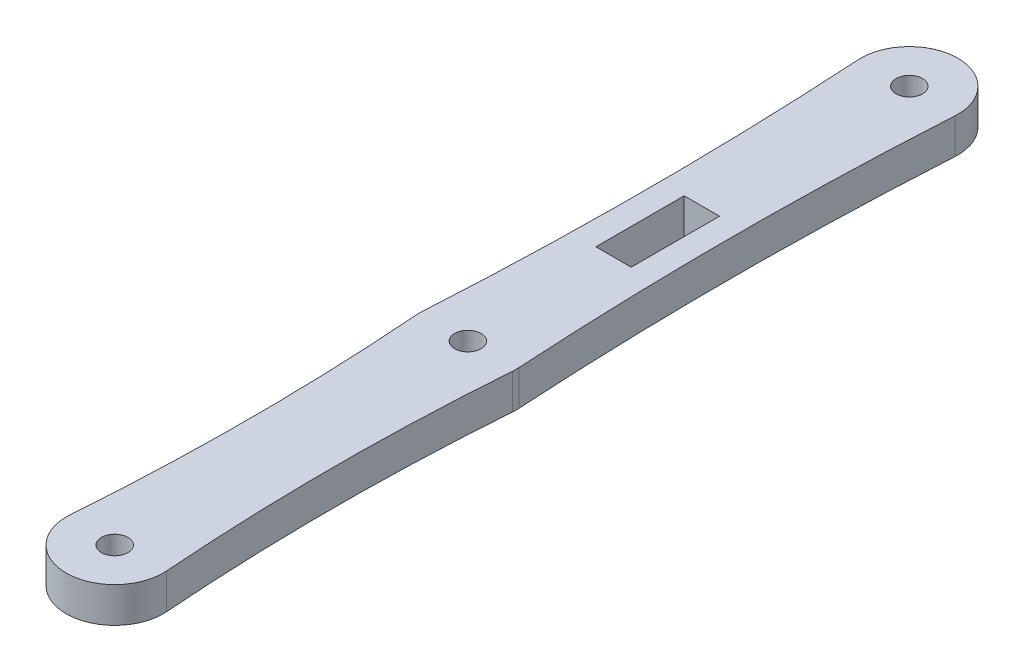
ISO-10303-21;
HEADER;
FILE_DESCRIPTION(('STEP AP214'),'2;1');
FILE_NAME('part.step','',(''),(''),'','','');
FILE_SCHEMA(('AUTOMOTIVE_DESIGN { 1 0 10303 214 1 1 1 1 }'));
ENDSEC;
DATA;
#1=APPLICATION_CONTEXT('core data for automotive mechanical design processes');
#2=APPLICATION_PROTOCOL_DEFINITION('international standard','automotive_design',2000,#1);
#3=PRODUCT_CONTEXT('',#1,'mechanical');
#4=PRODUCT('Part','Part','',(#3));
#5=PRODUCT_RELATED_PRODUCT_CATEGORY('part','',(#4));
#6=PRODUCT_DEFINITION_FORMATION('','',#4);
#7=PRODUCT_DEFINITION_CONTEXT('part definition',#1,'design');
#8=PRODUCT_DEFINITION('design','',#6,#7);
#9=PRODUCT_DEFINITION_SHAPE('','',#8);
#10=(LENGTH_UNIT() NAMED_UNIT(*) SI_UNIT(.MILLI.,.METRE.));
#11=(NAMED_UNIT(*) PLANE_ANGLE_UNIT() SI_UNIT($,.RADIAN.));
#12=(NAMED_UNIT(*) SI_UNIT($,.STERADIAN.) SOLID_ANGLE_UNIT());
#13=UNCERTAINTY_MEASURE_WITH_UNIT(LENGTH_MEASURE(1.E-05),#10,'distance_accuracy_value','');
#14=(GEOMETRIC_REPRESENTATION_CONTEXT(3) GLOBAL_UNCERTAINTY_ASSIGNED_CONTEXT((#13)) GLOBAL_UNIT_ASSIGNED_CONTEXT((#10,
#11,#12)) REPRESENTATION_CONTEXT('',''));
#15=CARTESIAN_POINT('',(0.,0.,0.));
#16=DIRECTION('',(0.,0.,1.));
#17=DIRECTION('',(1.,0.,0.));
#18=AXIS2_PLACEMENT_3D('',#15,#16,#17);
#19=CARTESIAN_POINT('',(-208.145833333263,4.,-77.5));
#20=DIRECTION('',(0.,1.,0.));
#21=DIRECTION('',(0.,0.,1.));
#22=AXIS2_PLACEMENT_3D('',#19,#20,#21);
#23=PLANE('',#22);
#24=CARTESIAN_POINT('',(0.,4.,0.));
#25=DIRECTION('',(0.,1.,0.));
#26=DIRECTION('',(0.,0.,1.));
#27=AXIS2_PLACEMENT_3D('',#24,#25,#26);
#28=CIRCLE('',#27,1.5);
#29=CARTESIAN_POINT('',(0.,4.,1.5));
#30=VERTEX_POINT('',#29);
#31=EDGE_CURVE('E166',#30,#30,#28,.T.);
#32=ORIENTED_EDGE('',*,*,#31,.F.);
#33=EDGE_LOOP('',(#32));
#34=FACE_BOUND('',#33,.T.);
#35=CARTESIAN_POINT('',(-416.291666666526,4.,-64.9999999999999));
#36=DIRECTION('',(0.,-1.,0.));
#37=DIRECTION('',(0.,0.,1.));
#38=AXIS2_PLACEMENT_3D('',#35,#36,#37);
#39=CIRCLE('',#38,411.541666666525);
#40=CARTESIAN_POINT('',(-5.49010890198864,4.,-89.6702967329402));
#41=VERTEX_POINT('',#40);
#42=CARTESIAN_POINT('',(-5.49010890198855,4.,-40.3297032670598));
#43=VERTEX_POINT('',#42);
#44=EDGE_CURVE('E178',#41,#43,#39,.T.);
#45=ORIENTED_EDGE('',*,*,#44,.T.);
#46=CARTESIAN_POINT('',(0.,4.,-40.));
#47=DIRECTION('',(0.,1.,0.));
#48=DIRECTION('',(0.,0.,1.));
#49=AXIS2_PLACEMENT_3D('',#46,#47,#48);
#50=CIRCLE('',#49,5.50000000000034);
#51=CARTESIAN_POINT('',(-5.48455297238287,4.,-39.5880792635355));
#52=VERTEX_POINT('',#51);
#53=EDGE_CURVE('E181',#43,#52,#50,.T.);
#54=ORIENTED_EDGE('',*,*,#53,.T.);
#55=CARTESIAN_POINT('',(-266.29166666658,4.,-20.));
#56=DIRECTION('',(0.,-1.,0.));
#57=DIRECTION('',(0.,0.,1.));
#58=AXIS2_PLACEMENT_3D('',#55,#56,#57);
#59=CIRCLE('',#58,261.54166666658);
#60=CARTESIAN_POINT('',(-5.48455297238286,4.,-0.411920736464504));
#61=VERTEX_POINT('',#60);
#62=EDGE_CURVE('E184',#52,#61,#59,.T.);
#63=ORIENTED_EDGE('',*,*,#62,.T.);
#64=CARTESIAN_POINT('',(0.,4.,0.));
#65=DIRECTION('',(0.,1.,0.));
#66=DIRECTION('',(0.,0.,1.));
#67=AXIS2_PLACEMENT_3D('',#64,#65,#66);
#68=CIRCLE('',#67,5.50000000000029);
#69=CARTESIAN_POINT('',(5.48455297238287,4.,-0.411920736464386));
#70=VERTEX_POINT('',#69);
#71=EDGE_CURVE('E186',#61,#70,#68,.T.);
#72=ORIENTED_EDGE('',*,*,#71,.T.);
#73=CARTESIAN_POINT('',(266.29166666658,4.,-20.));
#74=DIRECTION('',(0.,-1.,0.));
#75=DIRECTION('',(0.,0.,-1.));
#76=AXIS2_PLACEMENT_3D('',#73,#74,#75);
#77=CIRCLE('',#76,261.54166666658);
#78=CARTESIAN_POINT('',(5.48455297238292,4.,-39.5880792635355));
#79=VERTEX_POINT('',#78);
#80=EDGE_CURVE('E188',#70,#79,#77,.T.);
#81=ORIENTED_EDGE('',*,*,#80,.T.);
#82=CARTESIAN_POINT('',(0.,4.,-40.));
#83=DIRECTION('',(0.,1.,0.));
#84=DIRECTION('',(0.,0.,1.));
#85=AXIS2_PLACEMENT_3D('',#82,#83,#84);
#86=CIRCLE('',#85,5.50000000000035);
#87=CARTESIAN_POINT('',(5.49010890198859,4.,-40.3297032670596));
#88=VERTEX_POINT('',#87);
#89=EDGE_CURVE('E190',#79,#88,#86,.T.);
#90=ORIENTED_EDGE('',*,*,#89,.T.);
#91=CARTESIAN_POINT('',(416.291666666526,4.,-64.9999999999999));
#92=DIRECTION('',(0.,-1.,0.));
#93=DIRECTION('',(0.,0.,-1.));
#94=AXIS2_PLACEMENT_3D('',#91,#92,#93);
#95=CIRCLE('',#94,411.541666666525);
#96=CARTESIAN_POINT('',(5.49010890198861,4.,-89.6702967329402));
#97=VERTEX_POINT('',#96);
#98=EDGE_CURVE('E192',#88,#97,#95,.T.);
#99=ORIENTED_EDGE('',*,*,#98,.T.);
#100=CARTESIAN_POINT('',(0.,4.,-90.));
#101=DIRECTION('',(0.,1.,0.));
#102=DIRECTION('',(0.,0.,1.));
#103=AXIS2_PLACEMENT_3D('',#100,#101,#102);
#104=CIRCLE('',#103,5.50000000000042);
#105=EDGE_CURVE('E194',#97,#41,#104,.T.);
#106=ORIENTED_EDGE('',*,*,#105,.T.);
#107=EDGE_LOOP('',(#45,#54,#63,#72,#81,#90,#99,#106));
#108=FACE_BOUND('',#107,.T.);
#109=CARTESIAN_POINT('',(0.,4.,-40.));
#110=DIRECTION('',(0.,1.,0.));
#111=DIRECTION('',(0.,0.,1.));
#112=AXIS2_PLACEMENT_3D('',#109,#110,#111);
#113=CIRCLE('',#112,1.5);
#114=CARTESIAN_POINT('',(0.,4.,-38.5));
#115=VERTEX_POINT('',#114);
#116=EDGE_CURVE('E172',#115,#115,#113,.T.);
#117=ORIENTED_EDGE('',*,*,#116,.F.);
#118=EDGE_LOOP('',(#117));
#119=FACE_BOUND('',#118,.T.);
#120=CARTESIAN_POINT('',(0.,4.,-90.));
#121=DIRECTION('',(0.,1.,0.));
#122=DIRECTION('',(0.,0.,1.));
#123=AXIS2_PLACEMENT_3D('',#120,#121,#122);
#124=CIRCLE('',#123,1.5);
#125=CARTESIAN_POINT('',(0.,4.,-88.5));
#126=VERTEX_POINT('',#125);
#127=EDGE_CURVE('E160',#126,#126,#124,.T.);
#128=ORIENTED_EDGE('',*,*,#127,.F.);
#129=EDGE_LOOP('',(#128));
#130=FACE_BOUND('',#129,.T.);
#131=DIRECTION('',(-1.,0.,0.));
#132=VECTOR('',#131,1.);
#133=CARTESIAN_POINT('',(2.,4.,-66.5));
#134=LINE('',#133,#132);
#135=CARTESIAN_POINT('',(2.,4.,-66.5));
#136=VERTEX_POINT('',#135);
#137=CARTESIAN_POINT('',(-2.,4.,-66.5));
#138=VERTEX_POINT('',#137);
#139=EDGE_CURVE('E132',#136,#138,#134,.T.);
#140=ORIENTED_EDGE('',*,*,#139,.F.);
#141=DIRECTION('',(0.,0.,-1.));
#142=VECTOR('',#141,1.);
#143=CARTESIAN_POINT('',(2.,4.,-56.5));
#144=LINE('',#143,#142);
#145=CARTESIAN_POINT('',(2.,4.,-56.5));
#146=VERTEX_POINT('',#145);
#147=EDGE_CURVE('E124',#146,#136,#144,.T.);
#148=ORIENTED_EDGE('',*,*,#147,.F.);
#149=DIRECTION('',(1.,0.,0.));
#150=VECTOR('',#149,1.);
#151=CARTESIAN_POINT('',(2.,4.,-56.5));
#152=LINE('',#151,#150);
#153=CARTESIAN_POINT('',(-2.,4.,-56.5));
#154=VERTEX_POINT('',#153);
#155=EDGE_CURVE('E146',#154,#146,#152,.T.);
#156=ORIENTED_EDGE('',*,*,#155,.F.);
#157=DIRECTION('',(0.,0.,1.));
#158=VECTOR('',#157,1.);
#159=CARTESIAN_POINT('',(-2.,4.,-56.5));
#160=LINE('',#159,#158);
#161=EDGE_CURVE('E144',#138,#154,#160,.T.);
#162=ORIENTED_EDGE('',*,*,#161,.F.);
#163=EDGE_LOOP('',(#140,#148,#156,#162));
#164=FACE_BOUND('',#163,.T.);
#165=ADVANCED_FACE('F35',(#34,#108,#119,#130,#164),#23,.T.);
#166=CARTESIAN_POINT('',(-208.145833333263,0.,-77.5));
#167=DIRECTION('',(0.,1.,0.));
#168=DIRECTION('',(0.,0.,1.));
#169=AXIS2_PLACEMENT_3D('',#166,#167,#168);
#170=PLANE('',#169);
#171=CARTESIAN_POINT('',(0.,0.,-90.));
#172=DIRECTION('',(0.,1.,0.));
#173=DIRECTION('',(0.,0.,1.));
#174=AXIS2_PLACEMENT_3D('',#171,#172,#173);
#175=CIRCLE('',#174,1.5);
#176=CARTESIAN_POINT('',(0.,0.,-88.5));
#177=VERTEX_POINT('',#176);
#178=EDGE_CURVE('E140',#177,#177,#175,.T.);
#179=ORIENTED_EDGE('',*,*,#178,.T.);
#180=EDGE_LOOP('',(#179));
#181=FACE_BOUND('',#180,.T.);
#182=CARTESIAN_POINT('',(0.,0.,0.));
#183=DIRECTION('',(0.,1.,0.));
#184=DIRECTION('',(0.,0.,1.));
#185=AXIS2_PLACEMENT_3D('',#182,#183,#184);
#186=CIRCLE('',#185,1.5);
#187=CARTESIAN_POINT('',(0.,0.,1.5));
#188=VERTEX_POINT('',#187);
#189=EDGE_CURVE('E163',#188,#188,#186,.T.);
#190=ORIENTED_EDGE('',*,*,#189,.T.);
#191=EDGE_LOOP('',(#190));
#192=FACE_BOUND('',#191,.T.);
#193=CARTESIAN_POINT('',(0.,0.,-40.));
#194=DIRECTION('',(0.,1.,0.));
#195=DIRECTION('',(0.,0.,1.));
#196=AXIS2_PLACEMENT_3D('',#193,#194,#195);
#197=CIRCLE('',#196,1.5);
#198=CARTESIAN_POINT('',(0.,0.,-38.5));
#199=VERTEX_POINT('',#198);
#200=EDGE_CURVE('E169',#199,#199,#197,.T.);
#201=ORIENTED_EDGE('',*,*,#200,.T.);
#202=EDGE_LOOP('',(#201));
#203=FACE_BOUND('',#202,.T.);
#204=CARTESIAN_POINT('',(-416.291666666526,0.,-64.9999999999999));
#205=DIRECTION('',(0.,-1.,0.));
#206=DIRECTION('',(0.,0.,1.));
#207=AXIS2_PLACEMENT_3D('',#204,#205,#206);
#208=CIRCLE('',#207,411.541666666525);
#209=CARTESIAN_POINT('',(-5.49010890198864,0.,-89.6702967329402));
#210=VERTEX_POINT('',#209);
#211=CARTESIAN_POINT('',(-5.49010890198855,0.,-40.3297032670598));
#212=VERTEX_POINT('',#211);
#213=EDGE_CURVE('E175',#210,#212,#208,.T.);
#214=ORIENTED_EDGE('',*,*,#213,.F.);
#215=CARTESIAN_POINT('',(0.,0.,-90.));
#216=DIRECTION('',(0.,1.,0.));
#217=DIRECTION('',(0.,0.,1.));
#218=AXIS2_PLACEMENT_3D('',#215,#216,#217);
#219=CIRCLE('',#218,5.50000000000042);
#220=CARTESIAN_POINT('',(5.49010890198861,0.,-89.6702967329402));
#221=VERTEX_POINT('',#220);
#222=EDGE_CURVE('E182',#221,#210,#219,.T.);
#223=ORIENTED_EDGE('',*,*,#222,.F.);
#224=CARTESIAN_POINT('',(416.291666666526,0.,-64.9999999999999));
#225=DIRECTION('',(0.,-1.,0.));
#226=DIRECTION('',(0.,0.,-1.));
#227=AXIS2_PLACEMENT_3D('',#224,#225,#226);
#228=CIRCLE('',#227,411.541666666525);
#229=CARTESIAN_POINT('',(5.49010890198859,0.,-40.3297032670596));
#230=VERTEX_POINT('',#229);
#231=EDGE_CURVE('E209',#230,#221,#228,.T.);
#232=ORIENTED_EDGE('',*,*,#231,.F.);
#233=CARTESIAN_POINT('',(0.,0.,-40.));
#234=DIRECTION('',(0.,1.,0.));
#235=DIRECTION('',(0.,0.,1.));
#236=AXIS2_PLACEMENT_3D('',#233,#234,#235);
#237=CIRCLE('',#236,5.50000000000035);
#238=CARTESIAN_POINT('',(5.48455297238292,0.,-39.5880792635355));
#239=VERTEX_POINT('',#238);
#240=EDGE_CURVE('E207',#239,#230,#237,.T.);
#241=ORIENTED_EDGE('',*,*,#240,.F.);
#242=CARTESIAN_POINT('',(266.29166666658,0.,-20.));
#243=DIRECTION('',(0.,-1.,0.));
#244=DIRECTION('',(0.,0.,-1.));
#245=AXIS2_PLACEMENT_3D('',#242,#243,#244);
#246=CIRCLE('',#245,261.54166666658);
#247=CARTESIAN_POINT('',(5.48455297238287,0.,-0.411920736464386));
#248=VERTEX_POINT('',#247);
#249=EDGE_CURVE('E205',#248,#239,#246,.T.);
#250=ORIENTED_EDGE('',*,*,#249,.F.);
#251=CARTESIAN_POINT('',(0.,0.,0.));
#252=DIRECTION('',(0.,1.,0.));
#253=DIRECTION('',(0.,0.,1.));
#254=AXIS2_PLACEMENT_3D('',#251,#252,#253);
#255=CIRCLE('',#254,5.50000000000029);
#256=CARTESIAN_POINT('',(-5.48455297238286,0.,-0.411920736464504));
#257=VERTEX_POINT('',#256);
#258=EDGE_CURVE('E203',#257,#248,#255,.T.);
#259=ORIENTED_EDGE('',*,*,#258,.F.);
#260=CARTESIAN_POINT('',(-266.29166666658,0.,-20.));
#261=DIRECTION('',(0.,-1.,0.));
#262=DIRECTION('',(0.,0.,1.));
#263=AXIS2_PLACEMENT_3D('',#260,#261,#262);
#264=CIRCLE('',#263,261.54166666658);
#265=CARTESIAN_POINT('',(-5.48455297238287,0.,-39.5880792635355));
#266=VERTEX_POINT('',#265);
#267=EDGE_CURVE('E201',#266,#257,#264,.T.);
#268=ORIENTED_EDGE('',*,*,#267,.F.);
#269=CARTESIAN_POINT('',(0.,0.,-40.));
#270=DIRECTION('',(0.,1.,0.));
#271=DIRECTION('',(0.,0.,1.));
#272=AXIS2_PLACEMENT_3D('',#269,#270,#271);
#273=CIRCLE('',#272,5.50000000000034);
#274=EDGE_CURVE('E199',#212,#266,#273,.T.);
#275=ORIENTED_EDGE('',*,*,#274,.F.);
#276=EDGE_LOOP('',(#214,#223,#232,#241,#250,#259,#268,#275));
#277=FACE_BOUND('',#276,.T.);
#278=DIRECTION('',(0.,0.,-1.));
#279=VECTOR('',#278,1.);
#280=CARTESIAN_POINT('',(2.,0.,-56.5));
#281=LINE('',#280,#279);
#282=CARTESIAN_POINT('',(2.,0.,-56.5));
#283=VERTEX_POINT('',#282);
#284=CARTESIAN_POINT('',(2.,0.,-66.5));
#285=VERTEX_POINT('',#284);
#286=EDGE_CURVE('E58',#283,#285,#281,.T.);
#287=ORIENTED_EDGE('',*,*,#286,.T.);
#288=DIRECTION('',(-1.,0.,0.));
#289=VECTOR('',#288,1.);
#290=CARTESIAN_POINT('',(2.,0.,-66.5));
#291=LINE('',#290,#289);
#292=CARTESIAN_POINT('',(-2.,0.,-66.5));
#293=VERTEX_POINT('',#292);
#294=EDGE_CURVE('E139',#285,#293,#291,.T.);
#295=ORIENTED_EDGE('',*,*,#294,.T.);
#296=DIRECTION('',(0.,0.,1.));
#297=VECTOR('',#296,1.);
#298=CARTESIAN_POINT('',(-2.,0.,-56.5));
#299=LINE('',#298,#297);
#300=CARTESIAN_POINT('',(-2.,0.,-56.5));
#301=VERTEX_POINT('',#300);
#302=EDGE_CURVE('E152',#293,#301,#299,.T.);
#303=ORIENTED_EDGE('',*,*,#302,.T.);
#304=DIRECTION('',(1.,0.,0.));
#305=VECTOR('',#304,1.);
#306=CARTESIAN_POINT('',(2.,0.,-56.5));
#307=LINE('',#306,#305);
#308=EDGE_CURVE('E133',#301,#283,#307,.T.);
#309=ORIENTED_EDGE('',*,*,#308,.T.);
#310=EDGE_LOOP('',(#287,#295,#303,#309));
#311=FACE_BOUND('',#310,.T.);
#312=ADVANCED_FACE('F239',(#181,#192,#203,#277,#311),#170,.F.);
#313=CARTESIAN_POINT('',(-416.291666666526,4.,-64.9999999999999));
#314=DIRECTION('',(0.,-1.,0.));
#315=DIRECTION('',(0.,0.,-1.));
#316=AXIS2_PLACEMENT_3D('',#313,#314,#315);
#317=CYLINDRICAL_SURFACE('',#316,411.541666666525);
#318=ORIENTED_EDGE('',*,*,#213,.T.);
#319=DIRECTION('',(0.,-1.,0.));
#320=VECTOR('',#319,1.);
#321=CARTESIAN_POINT('',(-5.49010890198855,4.,-40.3297032670598));
#322=LINE('',#321,#320);
#323=EDGE_CURVE('E11',#43,#212,#322,.T.);
#324=ORIENTED_EDGE('',*,*,#323,.F.);
#325=ORIENTED_EDGE('',*,*,#44,.F.);
#326=DIRECTION('',(0.,-1.,0.));
#327=VECTOR('',#326,1.);
#328=CARTESIAN_POINT('',(-5.49010890198864,4.,-89.6702967329402));
#329=LINE('',#328,#327);
#330=EDGE_CURVE('E196',#41,#210,#329,.T.);
#331=ORIENTED_EDGE('',*,*,#330,.T.);
#332=EDGE_LOOP('',(#318,#324,#325,#331));
#333=FACE_BOUND('',#332,.T.);
#334=ADVANCED_FACE('F37',(#333),#317,.F.);
#335=CARTESIAN_POINT('',(0.,4.,-40.));
#336=DIRECTION('',(0.,-1.,0.));
#337=DIRECTION('',(0.,0.,-1.));
#338=AXIS2_PLACEMENT_3D('',#335,#336,#337);
#339=CYLINDRICAL_SURFACE('',#338,5.50000000000034);
#340=ORIENTED_EDGE('',*,*,#274,.T.);
#341=DIRECTION('',(0.,-1.,0.));
#342=VECTOR('',#341,1.);
#343=CARTESIAN_POINT('',(-5.48455297238287,4.,-39.5880792635355));
#344=LINE('',#343,#342);
#345=EDGE_CURVE('E43',#52,#266,#344,.T.);
#346=ORIENTED_EDGE('',*,*,#345,.F.);
#347=ORIENTED_EDGE('',*,*,#53,.F.);
#348=ORIENTED_EDGE('',*,*,#323,.T.);
#349=EDGE_LOOP('',(#340,#346,#347,#348));
#350=FACE_BOUND('',#349,.T.);
#351=ADVANCED_FACE('F257',(#350),#339,.T.);
#352=CARTESIAN_POINT('',(-266.29166666658,4.,-20.));
#353=DIRECTION('',(0.,-1.,0.));
#354=DIRECTION('',(0.,0.,-1.));
#355=AXIS2_PLACEMENT_3D('',#352,#353,#354);
#356=CYLINDRICAL_SURFACE('',#355,261.54166666658);
#357=ORIENTED_EDGE('',*,*,#267,.T.);
#358=DIRECTION('',(0.,-1.,0.));
#359=VECTOR('',#358,1.);
#360=CARTESIAN_POINT('',(-5.48455297238286,4.,-0.411920736464504));
#361=LINE('',#360,#359);
#362=EDGE_CURVE('E226',#61,#257,#361,.T.);
#363=ORIENTED_EDGE('',*,*,#362,.F.);
#364=ORIENTED_EDGE('',*,*,#62,.F.);
#365=ORIENTED_EDGE('',*,*,#345,.T.);
#366=EDGE_LOOP('',(#357,#363,#364,#365));
#367=FACE_BOUND('',#366,.T.);
#368=ADVANCED_FACE('F233',(#367),#356,.F.);
#369=CARTESIAN_POINT('',(0.,4.,0.));
#370=DIRECTION('',(0.,-1.,0.));
#371=DIRECTION('',(0.,0.,-1.));
#372=AXIS2_PLACEMENT_3D('',#369,#370,#371);
#373=CYLINDRICAL_SURFACE('',#372,5.50000000000029);
#374=ORIENTED_EDGE('',*,*,#258,.T.);
#375=DIRECTION('',(0.,-1.,0.));
#376=VECTOR('',#375,1.);
#377=CARTESIAN_POINT('',(5.48455297238287,4.,-0.411920736464386));
#378=LINE('',#377,#376);
#379=EDGE_CURVE('E223',#70,#248,#378,.T.);
#380=ORIENTED_EDGE('',*,*,#379,.F.);
#381=ORIENTED_EDGE('',*,*,#71,.F.);
#382=ORIENTED_EDGE('',*,*,#362,.T.);
#383=EDGE_LOOP('',(#374,#380,#381,#382));
#384=FACE_BOUND('',#383,.T.);
#385=ADVANCED_FACE('F245',(#384),#373,.T.);
#386=CARTESIAN_POINT('',(266.29166666658,4.,-20.));
#387=DIRECTION('',(0.,-1.,0.));
#388=DIRECTION('',(0.,0.,-1.));
#389=AXIS2_PLACEMENT_3D('',#386,#387,#388);
#390=CYLINDRICAL_SURFACE('',#389,261.54166666658);
#391=ORIENTED_EDGE('',*,*,#249,.T.);
#392=DIRECTION('',(0.,-1.,0.));
#393=VECTOR('',#392,1.);
#394=CARTESIAN_POINT('',(5.48455297238292,4.,-39.5880792635355));
#395=LINE('',#394,#393);
#396=EDGE_CURVE('E220',#79,#239,#395,.T.);
#397=ORIENTED_EDGE('',*,*,#396,.F.);
#398=ORIENTED_EDGE('',*,*,#80,.F.);
#399=ORIENTED_EDGE('',*,*,#379,.T.);
#400=EDGE_LOOP('',(#391,#397,#398,#399));
#401=FACE_BOUND('',#400,.T.);
#402=ADVANCED_FACE('F249',(#401),#390,.F.);
#403=CARTESIAN_POINT('',(0.,4.,-40.));
#404=DIRECTION('',(0.,-1.,0.));
#405=DIRECTION('',(0.,0.,-1.));
#406=AXIS2_PLACEMENT_3D('',#403,#404,#405);
#407=CYLINDRICAL_SURFACE('',#406,5.50000000000035);
#408=ORIENTED_EDGE('',*,*,#240,.T.);
#409=DIRECTION('',(0.,-1.,0.));
#410=VECTOR('',#409,1.);
#411=CARTESIAN_POINT('',(5.49010890198859,4.,-40.3297032670596));
#412=LINE('',#411,#410);
#413=EDGE_CURVE('E217',#88,#230,#412,.T.);
#414=ORIENTED_EDGE('',*,*,#413,.F.);
#415=ORIENTED_EDGE('',*,*,#89,.F.);
#416=ORIENTED_EDGE('',*,*,#396,.T.);
#417=EDGE_LOOP('',(#408,#414,#415,#416));
#418=FACE_BOUND('',#417,.T.);
#419=ADVANCED_FACE('F270',(#418),#407,.T.);
#420=CARTESIAN_POINT('',(416.291666666526,4.,-64.9999999999999));
#421=DIRECTION('',(0.,-1.,0.));
#422=DIRECTION('',(0.,0.,-1.));
#423=AXIS2_PLACEMENT_3D('',#420,#421,#422);
#424=CYLINDRICAL_SURFACE('',#423,411.541666666525);
#425=ORIENTED_EDGE('',*,*,#231,.T.);
#426=DIRECTION('',(0.,-1.,0.));
#427=VECTOR('',#426,1.);
#428=CARTESIAN_POINT('',(5.49010890198861,4.,-89.6702967329402));
#429=LINE('',#428,#427);
#430=EDGE_CURVE('E214',#97,#221,#429,.T.);
#431=ORIENTED_EDGE('',*,*,#430,.F.);
#432=ORIENTED_EDGE('',*,*,#98,.F.);
#433=ORIENTED_EDGE('',*,*,#413,.T.);
#434=EDGE_LOOP('',(#425,#431,#432,#433));
#435=FACE_BOUND('',#434,.T.);
#436=ADVANCED_FACE('F268',(#435),#424,.F.);
#437=CARTESIAN_POINT('',(0.,4.,-90.));
#438=DIRECTION('',(0.,-1.,0.));
#439=DIRECTION('',(0.,0.,-1.));
#440=AXIS2_PLACEMENT_3D('',#437,#438,#439);
#441=CYLINDRICAL_SURFACE('',#440,5.50000000000042);
#442=ORIENTED_EDGE('',*,*,#222,.T.);
#443=ORIENTED_EDGE('',*,*,#330,.F.);
#444=ORIENTED_EDGE('',*,*,#105,.F.);
#445=ORIENTED_EDGE('',*,*,#430,.T.);
#446=EDGE_LOOP('',(#442,#443,#444,#445));
#447=FACE_BOUND('',#446,.T.);
#448=ADVANCED_FACE('F263',(#447),#441,.T.);
#449=CARTESIAN_POINT('',(0.,4.,-40.));
#450=DIRECTION('',(0.,-1.,0.));
#451=DIRECTION('',(0.,0.,-1.));
#452=AXIS2_PLACEMENT_3D('',#449,#450,#451);
#453=CYLINDRICAL_SURFACE('',#452,1.5);
#454=ORIENTED_EDGE('',*,*,#116,.T.);
#455=EDGE_LOOP('',(#454));
#456=FACE_BOUND('',#455,.T.);
#457=ORIENTED_EDGE('',*,*,#200,.F.);
#458=EDGE_LOOP('',(#457));
#459=FACE_BOUND('',#458,.T.);
#460=ADVANCED_FACE('F289',(#456,#459),#453,.F.);
#461=CARTESIAN_POINT('',(0.,4.,0.));
#462=DIRECTION('',(0.,-1.,0.));
#463=DIRECTION('',(0.,0.,-1.));
#464=AXIS2_PLACEMENT_3D('',#461,#462,#463);
#465=CYLINDRICAL_SURFACE('',#464,1.5);
#466=ORIENTED_EDGE('',*,*,#31,.T.);
#467=EDGE_LOOP('',(#466));
#468=FACE_BOUND('',#467,.T.);
#469=ORIENTED_EDGE('',*,*,#189,.F.);
#470=EDGE_LOOP('',(#469));
#471=FACE_BOUND('',#470,.T.);
#472=ADVANCED_FACE('F296',(#468,#471),#465,.F.);
#473=CARTESIAN_POINT('',(0.,4.,-90.));
#474=DIRECTION('',(0.,-1.,0.));
#475=DIRECTION('',(0.,0.,-1.));
#476=AXIS2_PLACEMENT_3D('',#473,#474,#475);
#477=CYLINDRICAL_SURFACE('',#476,1.5);
#478=ORIENTED_EDGE('',*,*,#127,.T.);
#479=EDGE_LOOP('',(#478));
#480=FACE_BOUND('',#479,.T.);
#481=ORIENTED_EDGE('',*,*,#178,.F.);
#482=EDGE_LOOP('',(#481));
#483=FACE_BOUND('',#482,.T.);
#484=ADVANCED_FACE('F301',(#480,#483),#477,.F.);
#485=CARTESIAN_POINT('',(2.,4.,-56.5));
#486=DIRECTION('',(-1.,0.,0.));
#487=DIRECTION('',(0.,0.,1.));
#488=AXIS2_PLACEMENT_3D('',#485,#486,#487);
#489=PLANE('',#488);
#490=ORIENTED_EDGE('',*,*,#286,.F.);
#491=DIRECTION('',(0.,-1.,0.));
#492=VECTOR('',#491,1.);
#493=CARTESIAN_POINT('',(2.,4.,-56.5));
#494=LINE('',#493,#492);
#495=EDGE_CURVE('E128',#146,#283,#494,.T.);
#496=ORIENTED_EDGE('',*,*,#495,.F.);
#497=ORIENTED_EDGE('',*,*,#147,.T.);
#498=DIRECTION('',(0.,-1.,0.));
#499=VECTOR('',#498,1.);
#500=CARTESIAN_POINT('',(2.,4.,-66.5));
#501=LINE('',#500,#499);
#502=EDGE_CURVE('E127',#136,#285,#501,.T.);
#503=ORIENTED_EDGE('',*,*,#502,.T.);
#504=EDGE_LOOP('',(#490,#496,#497,#503));
#505=FACE_BOUND('',#504,.T.);
#506=ADVANCED_FACE('F126',(#505),#489,.T.);
#507=CARTESIAN_POINT('',(2.,4.,-66.5));
#508=DIRECTION('',(0.,0.,1.));
#509=DIRECTION('',(1.,0.,0.));
#510=AXIS2_PLACEMENT_3D('',#507,#508,#509);
#511=PLANE('',#510);
#512=ORIENTED_EDGE('',*,*,#294,.F.);
#513=ORIENTED_EDGE('',*,*,#502,.F.);
#514=ORIENTED_EDGE('',*,*,#139,.T.);
#515=DIRECTION('',(0.,-1.,0.));
#516=VECTOR('',#515,1.);
#517=CARTESIAN_POINT('',(-2.,4.,-66.5));
#518=LINE('',#517,#516);
#519=EDGE_CURVE('E141',#138,#293,#518,.T.);
#520=ORIENTED_EDGE('',*,*,#519,.T.);
#521=EDGE_LOOP('',(#512,#513,#514,#520));
#522=FACE_BOUND('',#521,.T.);
#523=ADVANCED_FACE('F136',(#522),#511,.T.);
#524=CARTESIAN_POINT('',(-2.,4.,-56.5));
#525=DIRECTION('',(1.,0.,0.));
#526=DIRECTION('',(0.,0.,-1.));
#527=AXIS2_PLACEMENT_3D('',#524,#525,#526);
#528=PLANE('',#527);
#529=ORIENTED_EDGE('',*,*,#302,.F.);
#530=ORIENTED_EDGE('',*,*,#519,.F.);
#531=ORIENTED_EDGE('',*,*,#161,.T.);
#532=DIRECTION('',(0.,-1.,0.));
#533=VECTOR('',#532,1.);
#534=CARTESIAN_POINT('',(-2.,4.,-56.5));
#535=LINE('',#534,#533);
#536=EDGE_CURVE('E50',#154,#301,#535,.T.);
#537=ORIENTED_EDGE('',*,*,#536,.T.);
#538=EDGE_LOOP('',(#529,#530,#531,#537));
#539=FACE_BOUND('',#538,.T.);
#540=ADVANCED_FACE('F324',(#539),#528,.T.);
#541=CARTESIAN_POINT('',(2.,4.,-56.5));
#542=DIRECTION('',(0.,0.,-1.));
#543=DIRECTION('',(-1.,0.,0.));
#544=AXIS2_PLACEMENT_3D('',#541,#542,#543);
#545=PLANE('',#544);
#546=ORIENTED_EDGE('',*,*,#308,.F.);
#547=ORIENTED_EDGE('',*,*,#536,.F.);
#548=ORIENTED_EDGE('',*,*,#155,.T.);
#549=ORIENTED_EDGE('',*,*,#495,.T.);
#550=EDGE_LOOP('',(#546,#547,#548,#549));
#551=FACE_BOUND('',#550,.T.);
#552=ADVANCED_FACE('F327',(#551),#545,.T.);
#553=CLOSED_SHELL('',(#165,#312,#334,#351,#368,#385,#402,#419,#436,#448,#460,#472,#484,#506,
#523,#540,#552));
#554=MANIFOLD_SOLID_BREP('B2',#553);
#555=ADVANCED_BREP_SHAPE_REPRESENTATION('',(#18,#554),#14);
#556=SHAPE_DEFINITION_REPRESENTATION(#9,#555);
ENDSEC;
END-ISO-10303-21;
